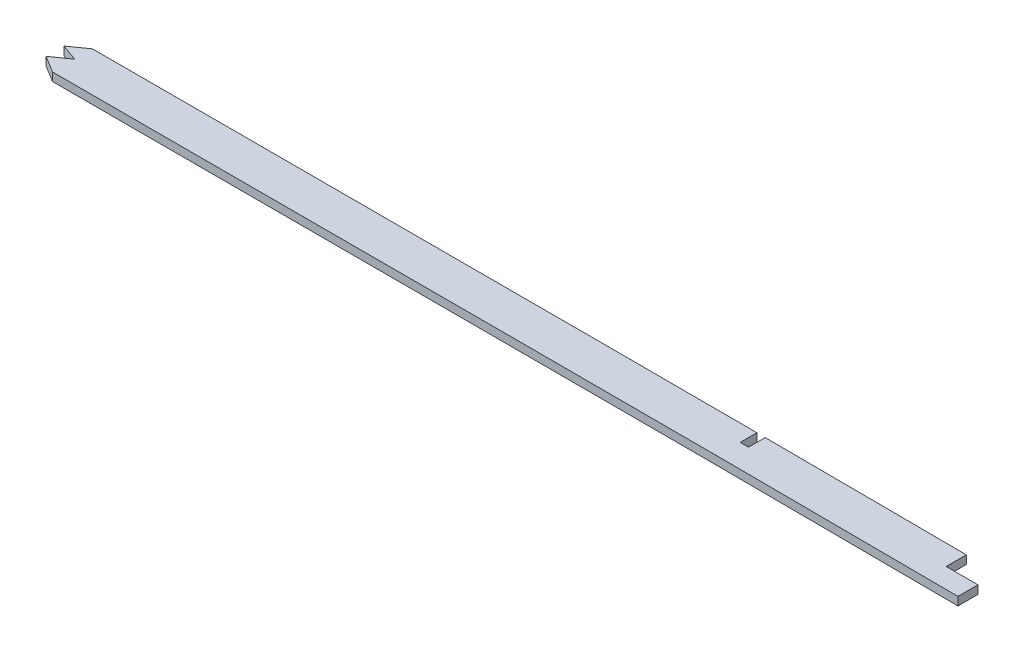
ISO-10303-21;
HEADER;
FILE_DESCRIPTION(('STEP AP214'),'2;1');
FILE_NAME('part.step','',(''),(''),'','','');
FILE_SCHEMA(('AUTOMOTIVE_DESIGN { 1 0 10303 214 1 1 1 1 }'));
ENDSEC;
DATA;
#1=APPLICATION_CONTEXT('core data for automotive mechanical design processes');
#2=APPLICATION_PROTOCOL_DEFINITION('international standard','automotive_design',2000,#1);
#3=PRODUCT_CONTEXT('',#1,'mechanical');
#4=PRODUCT('Part','Part','',(#3));
#5=PRODUCT_RELATED_PRODUCT_CATEGORY('part','',(#4));
#6=PRODUCT_DEFINITION_FORMATION('','',#4);
#7=PRODUCT_DEFINITION_CONTEXT('part definition',#1,'design');
#8=PRODUCT_DEFINITION('design','',#6,#7);
#9=PRODUCT_DEFINITION_SHAPE('','',#8);
#10=(LENGTH_UNIT() NAMED_UNIT(*) SI_UNIT(.MILLI.,.METRE.));
#11=(NAMED_UNIT(*) PLANE_ANGLE_UNIT() SI_UNIT($,.RADIAN.));
#12=(NAMED_UNIT(*) SI_UNIT($,.STERADIAN.) SOLID_ANGLE_UNIT());
#13=UNCERTAINTY_MEASURE_WITH_UNIT(LENGTH_MEASURE(1.E-05),#10,'distance_accuracy_value','');
#14=(GEOMETRIC_REPRESENTATION_CONTEXT(3) GLOBAL_UNCERTAINTY_ASSIGNED_CONTEXT((#13)) GLOBAL_UNIT_ASSIGNED_CONTEXT((#10,
#11,#12)) REPRESENTATION_CONTEXT('',''));
#15=CARTESIAN_POINT('',(0.,0.,0.));
#16=DIRECTION('',(0.,0.,1.));
#17=DIRECTION('',(1.,0.,0.));
#18=AXIS2_PLACEMENT_3D('',#15,#16,#17);
#19=CARTESIAN_POINT('',(616.337750913255,1.5875,99.0566103609531));
#20=CARTESIAN_POINT('',(647.76049660052,1.5875,99.0799542657679));
#21=CARTESIAN_POINT('',(694.87068034325,1.5875,98.960929783245));
#22=CARTESIAN_POINT('',(757.779786958647,1.5875,98.8040630386954));
#23=CARTESIAN_POINT('',(820.69045818609,1.5875,98.7653484328497));
#24=CARTESIAN_POINT('',(899.289299877085,1.5875,98.7967965825531));
#25=CARTESIAN_POINT('',(993.586772551322,1.5875,98.8129149281116));
#26=CARTESIAN_POINT('',(1087.93191592796,1.5875,98.7323574871025));
#27=CARTESIAN_POINT('',(1182.33953079348,1.5875,99.1244994990799));
#28=CARTESIAN_POINT('',(1276.65398068122,1.5875,99.8147611994573));
#29=CARTESIAN_POINT('',(1370.85083148495,1.5875,100.131815232071));
#30=CARTESIAN_POINT('',(1464.98207813977,1.5875,99.4108190462021));
#31=CARTESIAN_POINT('',(1590.54945268054,1.5875,97.1511702631117));
#32=CARTESIAN_POINT('',(1747.54008126415,1.5875,92.7833872927443));
#33=CARTESIAN_POINT('',(1904.58058478476,1.5875,87.4795525069474));
#34=CARTESIAN_POINT('',(2030.20455421821,1.5875,82.9558758992198));
#35=CARTESIAN_POINT('',(2092.98705848864,1.5875,80.5357121207426));
#36=CARTESIAN_POINT('',(2124.37829951673,1.5875,79.2527491986346));
#37=B_SPLINE_CURVE_WITH_KNOTS('',3,(#19,#20,#21,#22,#23,#24,#25,#26,#27,#28,#29,#30,#31,#32,#33,
#34,#35,#36),.UNSPECIFIED.,.F.,.F.,(4,1,1,1,1,1,1,1,1,1,1,1,1,1,1,4),(0.,0.0625,0.09375,0.125,
0.1875,0.25,0.3125,0.375,0.4375,0.5,0.5625,0.625,0.75,0.875,0.9375,1.),.UNSPECIFIED.);
#38=DIRECTION('',(0.,-1.,0.));
#39=VECTOR('',#38,1.);
#40=SURFACE_OF_LINEAR_EXTRUSION('',#37,#39);
#41=DIRECTION('',(0.,1.,0.));
#42=VECTOR('',#41,1.);
#43=CARTESIAN_POINT('',(862.726409079902,-6.0325,98.7825807380737));
#44=LINE('',#43,#42);
#45=CARTESIAN_POINT('',(862.725924528318,-1.5875,98.7829220342023));
#46=VERTEX_POINT('',#45);
#47=CARTESIAN_POINT('',(862.726409079902,1.5875,98.7825807380737));
#48=VERTEX_POINT('',#47);
#49=EDGE_CURVE('E303',#46,#48,#44,.T.);
#50=ORIENTED_EDGE('',*,*,#49,.T.);
#51=CARTESIAN_POINT('',(1116.0125,1.5875,98.877614065112));
#52=VERTEX_POINT('',#51);
#53=EDGE_CURVE('E172',#48,#52,#37,.T.);
#54=ORIENTED_EDGE('',*,*,#53,.T.);
#55=DIRECTION('',(0.,1.,0.));
#56=VECTOR('',#55,1.);
#57=CARTESIAN_POINT('',(1116.0125,-1.59253086897977,98.877614065112));
#58=LINE('',#57,#56);
#59=CARTESIAN_POINT('',(1116.01250018965,-1.58995471158141,98.8776762728788));
#60=VERTEX_POINT('',#59);
#61=EDGE_CURVE('E188',#60,#52,#58,.T.);
#62=ORIENTED_EDGE('',*,*,#61,.F.);
#63=CARTESIAN_POINT('',(1116.01250074187,-1.5875,98.8776140673808));
#64=CARTESIAN_POINT('',(1106.65531040723,-1.5875,98.8489981589266));
#65=CARTESIAN_POINT('',(1065.83646905134,-1.5875,98.7512238812234));
#66=CARTESIAN_POINT('',(993.586772551322,-1.5875,98.8129149281116));
#67=CARTESIAN_POINT('',(918.537042966882,-1.5875,98.8000866153137));
#68=CARTESIAN_POINT('',(874.913020706691,-1.5875,98.785692804558));
#69=CARTESIAN_POINT('',(862.72544015111,-1.5875,98.7825804906388));
#70=B_SPLINE_CURVE_WITH_KNOTS('',3,(#63,#64,#65,#66,#67,#68,#69),.UNSPECIFIED.,.F.,.F.,(4,1,1,1,
4),(0.163271988919623,0.181859857981132,0.244359857981132,0.306859857981132,0.331087869061508),.UNSPECIFIED.);
#71=EDGE_CURVE('E168',#46,#60,#70,.F.);
#72=ORIENTED_EDGE('',*,*,#71,.F.);
#73=EDGE_LOOP('',(#50,#54,#62,#72));
#74=FACE_BOUND('',#73,.T.);
#75=ADVANCED_FACE('F40',(#74),#40,.T.);
#76=DIRECTION('',(0.,-1.,0.));
#77=VECTOR('',#76,1.);
#78=CARTESIAN_POINT('',(1196.22315473829,1.5875,99.2567866166123));
#79=LINE('',#78,#77);
#80=CARTESIAN_POINT('',(1196.2231559473,-1.5875,99.2573829498002));
#81=VERTEX_POINT('',#80);
#82=CARTESIAN_POINT('',(1196.22315473829,1.5875,99.2567866166594));
#83=VERTEX_POINT('',#82);
#84=EDGE_CURVE('E324',#81,#83,#79,.F.);
#85=ORIENTED_EDGE('',*,*,#84,.F.);
#86=CARTESIAN_POINT('',(1196.22315959104,-1.5875,99.2567866463332));
#87=CARTESIAN_POINT('',(1191.59045311481,-1.5875,99.2284133842702));
#88=CARTESIAN_POINT('',(1165.91778618443,-1.5875,99.0751842298858));
#89=CARTESIAN_POINT('',(1140.23477346268,-1.5875,98.955060692758));
#90=CARTESIAN_POINT('',(1119.18750086786,-1.5875,98.8875606885981));
#91=B_SPLINE_CURVE_WITH_KNOTS('',3,(#86,#87,#88,#89,#90),.UNSPECIFIED.,.F.,.F.,(4,1,4),
(0.333190221464989,0.342397001392713,0.384206779927724),.UNSPECIFIED.);
#92=CARTESIAN_POINT('',(1119.1875002271,-1.58994771977053,98.8876302496902));
#93=VERTEX_POINT('',#92);
#94=EDGE_CURVE('E174',#93,#81,#91,.F.);
#95=ORIENTED_EDGE('',*,*,#94,.F.);
#96=DIRECTION('',(0.,1.,0.));
#97=VECTOR('',#96,1.);
#98=CARTESIAN_POINT('',(1119.18750000942,-1.59253086897977,98.8875606858451));
#99=LINE('',#98,#97);
#100=CARTESIAN_POINT('',(1119.18750000942,1.5875,98.8875606858451));
#101=VERTEX_POINT('',#100);
#102=EDGE_CURVE('E192',#93,#101,#99,.T.);
#103=ORIENTED_EDGE('',*,*,#102,.T.);
#104=EDGE_CURVE('E167',#101,#83,#37,.T.);
#105=ORIENTED_EDGE('',*,*,#104,.T.);
#106=EDGE_LOOP('',(#85,#95,#103,#105));
#107=FACE_BOUND('',#106,.T.);
#108=ADVANCED_FACE('F227',(#107),#40,.T.);
#109=CARTESIAN_POINT('',(616.326429146063,1.5875,114.296606155493));
#110=CARTESIAN_POINT('',(632.046217380175,1.5875,114.30828435968));
#111=CARTESIAN_POINT('',(647.765968153244,1.5875,114.29677439422));
#112=CARTESIAN_POINT('',(679.205420392794,1.5875,114.24323397025));
#113=CARTESIAN_POINT('',(694.925123066751,1.5875,114.201950932506));
#114=CARTESIAN_POINT('',(726.364532124698,1.5875,114.121681346548));
#115=CARTESIAN_POINT('',(742.084243399862,1.5875,114.083543006226));
#116=CARTESIAN_POINT('',(773.523671882744,1.5875,114.034083388907));
#117=CARTESIAN_POINT('',(789.243390213417,1.5875,114.023396075664));
#118=CARTESIAN_POINT('',(820.682831324826,1.5875,114.017303041489));
#119=CARTESIAN_POINT('',(836.402553623007,1.5875,114.020240225192));
#120=CARTESIAN_POINT('',(867.841997842806,1.5875,114.024821457385));
#121=CARTESIAN_POINT('',(883.561720421664,1.5875,114.028722489467));
#122=CARTESIAN_POINT('',(915.001165910892,1.5875,114.037662965197));
#123=CARTESIAN_POINT('',(930.720888644625,1.5875,114.042095840025));
#124=CARTESIAN_POINT('',(962.160332217753,1.5875,114.044456392842));
#125=CARTESIAN_POINT('',(977.880053630737,1.5875,114.042025852399));
#126=CARTESIAN_POINT('',(1025.03924062521,1.5875,114.02635266127));
#127=CARTESIAN_POINT('',(1056.47872633141,1.5875,114.001081239981));
#128=CARTESIAN_POINT('',(1103.63774370583,1.5875,114.076141518065));
#129=CARTESIAN_POINT('',(1119.35738201238,1.5875,114.119430036675));
#130=CARTESIAN_POINT('',(1150.79658971577,1.5875,114.242868384306));
#131=CARTESIAN_POINT('',(1166.51615941665,1.5875,114.322855573181));
#132=CARTESIAN_POINT('',(1213.67480633689,1.5875,114.596079866728));
#133=CARTESIAN_POINT('',(1245.11381381393,1.5875,114.824335417931));
#134=CARTESIAN_POINT('',(1307.99206873737,1.5875,115.160349224997));
#135=CARTESIAN_POINT('',(1339.43132783757,1.5875,115.262775920084));
#136=CARTESIAN_POINT('',(1386.59071758969,1.5875,115.166774968219));
#137=CARTESIAN_POINT('',(1402.31059775436,1.5875,115.09313610926));
#138=CARTESIAN_POINT('',(1433.75053971329,1.5875,114.855373393272));
#139=CARTESIAN_POINT('',(1449.46971812607,1.5875,114.691491377402));
#140=CARTESIAN_POINT('',(1480.90524720166,1.5875,114.282993412757));
#141=CARTESIAN_POINT('',(1496.62184273389,1.5875,114.038617844409));
#142=CARTESIAN_POINT('',(1528.05323424889,1.5875,113.488096449305));
#143=CARTESIAN_POINT('',(1543.76803918056,1.5875,113.182257797232));
#144=CARTESIAN_POINT('',(1590.91012672281,1.5875,112.184857954141));
#145=CARTESIAN_POINT('',(1622.33508716355,1.5875,111.413587350345));
#146=CARTESIAN_POINT('',(1685.18062244756,1.5875,109.720508746898));
#147=CARTESIAN_POINT('',(1716.60120600918,1.5875,108.799000007991));
#148=CARTESIAN_POINT('',(1779.43954296825,1.5875,106.858836007746));
#149=CARTESIAN_POINT('',(1810.85730451947,1.5875,105.840460627799));
#150=CARTESIAN_POINT('',(1873.69102784609,1.5875,103.741931839349));
#151=CARTESIAN_POINT('',(1905.10699770462,1.5875,102.662055887814));
#152=CARTESIAN_POINT('',(1967.93740090808,1.5875,100.449562537391));
#153=CARTESIAN_POINT('',(1999.35184226252,1.5875,99.3172200683351));
#154=CARTESIAN_POINT('',(2062.17844269824,1.5875,96.9741951872324));
#155=CARTESIAN_POINT('',(2093.59060920955,1.5875,95.7637678134024));
#156=CARTESIAN_POINT('',(2125.00064017427,1.5875,94.4800369448474));
#157=B_SPLINE_CURVE_WITH_KNOTS('',3,(#109,#110,#111,#112,#113,#114,#115,#116,#117,#118,#119,
#120,#121,#122,#123,#124,#125,#126,#127,#128,#129,#130,#131,#132,#133,#134,#135,#136,#137,#138,
#139,#140,#141,#142,#143,#144,#145,#146,#147,#148,#149,#150,#151,#152,#153,#154,#155,#156),
.UNSPECIFIED.,.F.,.F.,(4,2,2,2,2,2,2,2,2,2,2,2,2,2,2,2,2,2,2,2,2,2,2,4),(0.,0.0312499999999999,
0.0624999999999998,0.0937499999999997,0.125,0.156249999999999,0.187499999999999,
0.218749999999999,0.249999999999999,0.312499999999999,0.343749999999999,0.374999999999999,
0.437499999999998,0.499999999999998,0.531249999999998,0.562499999999998,0.593749999999999,
0.624999999999999,0.687499999999999,0.749999999999999,0.812499999999999,0.875,0.9375,1.),.UNSPECIFIED.);
#158=DIRECTION('',(0.,-1.,0.));
#159=VECTOR('',#158,1.);
#160=SURFACE_OF_LINEAR_EXTRUSION('',#157,#159);
#161=CARTESIAN_POINT('',(1208.33439349657,1.5875,114.573476594544));
#162=CARTESIAN_POINT('',(1199.63483574893,1.5875,114.518266469403));
#163=CARTESIAN_POINT('',(1190.9352755331,1.5875,114.464333248765));
#164=CARTESIAN_POINT('',(1166.51615941665,1.5875,114.322855573181));
#165=CARTESIAN_POINT('',(1150.79658971577,1.5875,114.242868384306));
#166=CARTESIAN_POINT('',(1119.35738201238,1.5875,114.119430036675));
#167=CARTESIAN_POINT('',(1103.63774370583,1.5875,114.076141518065));
#168=CARTESIAN_POINT('',(1056.47872633141,1.5875,114.001081239981));
#169=CARTESIAN_POINT('',(1025.03924062521,1.5875,114.02635266127));
#170=CARTESIAN_POINT('',(977.880053630737,1.5875,114.042025852399));
#171=CARTESIAN_POINT('',(962.160332217753,1.5875,114.044456392842));
#172=CARTESIAN_POINT('',(930.720888644625,1.5875,114.042095840025));
#173=CARTESIAN_POINT('',(915.001165910892,1.5875,114.037662965197));
#174=CARTESIAN_POINT('',(887.096435546386,1.5875,114.029727660973));
#175=CARTESIAN_POINT('',(874.911428026087,1.5875,114.026604598587));
#176=CARTESIAN_POINT('',(862.726420746595,1.5875,114.024308472553));
#177=B_SPLINE_CURVE_WITH_KNOTS('',3,(#161,#162,#163,#164,#165,#166,#167,#168,#169,#170,#171,
#172,#173,#174,#175,#176),.UNSPECIFIED.,.F.,.F.,(4,2,2,2,2,2,2,4),(0.163276831798633,
0.180571314845172,0.211821314845171,0.243071314845171,0.305571314845171,0.336821314845171,
0.368071314845171,0.392294483046537),.UNSPECIFIED.);
#178=CARTESIAN_POINT('',(862.726420745253,1.5875,114.024315595952));
#179=VERTEX_POINT('',#178);
#180=CARTESIAN_POINT('',(1208.33439305176,1.5875,114.573511769636));
#181=VERTEX_POINT('',#180);
#182=EDGE_CURVE('E157',#179,#181,#177,.F.);
#183=ORIENTED_EDGE('',*,*,#182,.F.);
#184=DIRECTION('',(0.,1.,0.));
#185=VECTOR('',#184,1.);
#186=CARTESIAN_POINT('',(862.726409079902,-6.0325,114.024308470354));
#187=LINE('',#186,#185);
#188=CARTESIAN_POINT('',(862.726414914492,-1.5875,114.024312034321));
#189=VERTEX_POINT('',#188);
#190=EDGE_CURVE('E139',#189,#179,#187,.T.);
#191=ORIENTED_EDGE('',*,*,#190,.F.);
#192=CARTESIAN_POINT('',(862.726420750438,-1.5875,114.024308472554));
#193=CARTESIAN_POINT('',(874.911428028649,-1.5875,114.026604598588));
#194=CARTESIAN_POINT('',(887.096435547667,-1.5875,114.029727660974));
#195=CARTESIAN_POINT('',(915.001165910892,-1.5875,114.037662965197));
#196=CARTESIAN_POINT('',(930.720888644625,-1.5875,114.042095840025));
#197=CARTESIAN_POINT('',(962.160332217753,-1.5875,114.044456392842));
#198=CARTESIAN_POINT('',(977.880053630737,-1.5875,114.042025852399));
#199=CARTESIAN_POINT('',(1025.03924062521,-1.5875,114.02635266127));
#200=CARTESIAN_POINT('',(1056.47872633141,-1.5875,114.001081239981));
#201=CARTESIAN_POINT('',(1103.63774370583,-1.5875,114.076141518065));
#202=CARTESIAN_POINT('',(1119.35738201238,-1.5875,114.119430036675));
#203=CARTESIAN_POINT('',(1150.79658971577,-1.5875,114.242868384306));
#204=CARTESIAN_POINT('',(1166.51615941665,-1.5875,114.322855573181));
#205=CARTESIAN_POINT('',(1190.93527553355,-1.5875,114.464333248767));
#206=CARTESIAN_POINT('',(1199.63483574983,-1.5875,114.518266469408));
#207=CARTESIAN_POINT('',(1208.33439349792,-1.5875,114.573476594553));
#208=B_SPLINE_CURVE_WITH_KNOTS('',3,(#192,#193,#194,#195,#196,#197,#198,#199,#200,#201,#202,
#203,#204,#205,#206,#207),.UNSPECIFIED.,.F.,.F.,(4,2,2,2,2,2,2,4),(0.163276831801179,
0.187499999999999,0.218749999999999,0.249999999999999,0.312499999999999,0.343749999999999,
0.374999999999999,0.392294483047431),.UNSPECIFIED.);
#209=CARTESIAN_POINT('',(1208.33439316259,-1.5875,114.573529382344));
#210=VERTEX_POINT('',#209);
#211=EDGE_CURVE('E182',#189,#210,#208,.T.);
#212=ORIENTED_EDGE('',*,*,#211,.T.);
#213=DIRECTION('',(0.,-1.,0.));
#214=VECTOR('',#213,1.);
#215=CARTESIAN_POINT('',(1208.33439305176,1.5875,114.573476591721));
#216=LINE('',#215,#214);
#217=EDGE_CURVE('E165',#210,#181,#216,.F.);
#218=ORIENTED_EDGE('',*,*,#217,.T.);
#219=EDGE_LOOP('',(#183,#191,#212,#218));
#220=FACE_BOUND('',#219,.T.);
#221=ADVANCED_FACE('F42',(#220),#160,.F.);
#222=CARTESIAN_POINT('',(0.,1.5875,0.));
#223=DIRECTION('',(0.,1.,0.));
#224=DIRECTION('',(0.,0.,1.));
#225=AXIS2_PLACEMENT_3D('',#222,#223,#224);
#226=PLANE('',#225);
#227=DIRECTION('',(0.817598794620829,0.,-0.575788338744861));
#228=VECTOR('',#227,1.);
#229=CARTESIAN_POINT('',(862.726409079902,1.5875,98.7825807380737));
#230=LINE('',#229,#228);
#231=CARTESIAN_POINT('',(856.314728224219,1.5875,103.297962968019));
#232=VERTEX_POINT('',#231);
#233=EDGE_CURVE('E150',#232,#48,#230,.T.);
#234=ORIENTED_EDGE('',*,*,#233,.F.);
#235=DIRECTION('',(-0.941527703429056,0.,-0.336935577930867));
#236=VECTOR('',#235,1.);
#237=CARTESIAN_POINT('',(856.314728224219,1.5875,103.297962968019));
#238=LINE('',#237,#236);
#239=CARTESIAN_POINT('',(862.726409079902,1.5875,105.592450306788));
#240=VERTEX_POINT('',#239);
#241=EDGE_CURVE('E373',#240,#232,#238,.T.);
#242=ORIENTED_EDGE('',*,*,#241,.F.);
#243=DIRECTION('',(0.81759879462083,0.,-0.57578833874486));
#244=VECTOR('',#243,1.);
#245=CARTESIAN_POINT('',(862.726409079902,1.5875,105.592450306788));
#246=LINE('',#245,#244);
#247=CARTESIAN_POINT('',(856.314728224219,1.5875,110.107832536734));
#248=VERTEX_POINT('',#247);
#249=EDGE_CURVE('E160',#248,#240,#246,.T.);
#250=ORIENTED_EDGE('',*,*,#249,.F.);
#251=DIRECTION('',(-0.853386844339415,0.,-0.521278134884263));
#252=VECTOR('',#251,1.);
#253=CARTESIAN_POINT('',(856.314728224219,1.5875,110.107832536734));
#254=LINE('',#253,#252);
#255=EDGE_CURVE('E142',#179,#248,#254,.T.);
#256=ORIENTED_EDGE('',*,*,#255,.F.);
#257=ORIENTED_EDGE('',*,*,#182,.T.);
#258=DIRECTION('',(0.,0.,1.));
#259=VECTOR('',#258,1.);
#260=CARTESIAN_POINT('',(1208.33439305176,1.5875,120.259186156619));
#261=LINE('',#260,#259);
#262=CARTESIAN_POINT('',(1208.33439305176,1.5875,106.937874616711));
#263=VERTEX_POINT('',#262);
#264=EDGE_CURVE('E315',#263,#181,#261,.T.);
#265=ORIENTED_EDGE('',*,*,#264,.F.);
#266=DIRECTION('',(1.,0.,0.));
#267=VECTOR('',#266,1.);
#268=CARTESIAN_POINT('',(1196.22315473829,1.5875,106.937874616711));
#269=LINE('',#268,#267);
#270=CARTESIAN_POINT('',(1196.22315473829,1.5875,106.937874616711));
#271=VERTEX_POINT('',#270);
#272=EDGE_CURVE('E311',#271,#263,#269,.T.);
#273=ORIENTED_EDGE('',*,*,#272,.F.);
#274=DIRECTION('',(0.,0.,1.));
#275=VECTOR('',#274,1.);
#276=CARTESIAN_POINT('',(1196.22315473829,1.5875,99.2567866166123));
#277=LINE('',#276,#275);
#278=EDGE_CURVE('E308',#83,#271,#277,.T.);
#279=ORIENTED_EDGE('',*,*,#278,.F.);
#280=ORIENTED_EDGE('',*,*,#104,.F.);
#281=DIRECTION('',(-5.24930824727474E-13,0.,-1.));
#282=VECTOR('',#281,1.);
#283=CARTESIAN_POINT('',(1119.18749999994,1.5875,-5.8749601739965E-10));
#284=LINE('',#283,#282);
#285=CARTESIAN_POINT('',(1119.1875,1.5875,105.232528283411));
#286=VERTEX_POINT('',#285);
#287=EDGE_CURVE('E351',#286,#101,#284,.T.);
#288=ORIENTED_EDGE('',*,*,#287,.F.);
#289=DIRECTION('',(1.,0.,0.));
#290=VECTOR('',#289,1.);
#291=CARTESIAN_POINT('',(0.,1.5875,105.232528283411));
#292=LINE('',#291,#290);
#293=CARTESIAN_POINT('',(1116.0125,1.5875,105.232528283411));
#294=VERTEX_POINT('',#293);
#295=EDGE_CURVE('E364',#294,#286,#292,.T.);
#296=ORIENTED_EDGE('',*,*,#295,.F.);
#297=DIRECTION('',(0.,0.,1.));
#298=VECTOR('',#297,1.);
#299=CARTESIAN_POINT('',(1116.0125,1.5875,0.));
#300=LINE('',#299,#298);
#301=EDGE_CURVE('E331',#52,#294,#300,.T.);
#302=ORIENTED_EDGE('',*,*,#301,.F.);
#303=ORIENTED_EDGE('',*,*,#53,.F.);
#304=EDGE_LOOP('',(#234,#242,#250,#256,#257,#265,#273,#279,#280,#288,#296,#302,#303));
#305=FACE_BOUND('',#304,.T.);
#306=ADVANCED_FACE('F155',(#305),#226,.T.);
#307=CARTESIAN_POINT('',(0.,-1.5875,0.));
#308=DIRECTION('',(0.,1.,0.));
#309=DIRECTION('',(0.,0.,1.));
#310=AXIS2_PLACEMENT_3D('',#307,#308,#309);
#311=PLANE('',#310);
#312=DIRECTION('',(-0.941527703429056,0.,-0.336935577930867));
#313=VECTOR('',#312,1.);
#314=CARTESIAN_POINT('',(64.44398466162,-1.5875,-180.081299965069));
#315=LINE('',#314,#313);
#316=CARTESIAN_POINT('',(862.726409079902,-1.5875,105.592450306788));
#317=VERTEX_POINT('',#316);
#318=CARTESIAN_POINT('',(856.314728224219,-1.5875,103.297962968019));
#319=VERTEX_POINT('',#318);
#320=EDGE_CURVE('E53',#317,#319,#315,.T.);
#321=ORIENTED_EDGE('',*,*,#320,.T.);
#322=DIRECTION('',(0.817598794620829,0.,-0.575788338744861));
#323=VECTOR('',#322,1.);
#324=CARTESIAN_POINT('',(332.524862110729,-1.5875,472.173380648578));
#325=LINE('',#324,#323);
#326=EDGE_CURVE('E11',#319,#46,#325,.T.);
#327=ORIENTED_EDGE('',*,*,#326,.T.);
#328=ORIENTED_EDGE('',*,*,#71,.T.);
#329=DIRECTION('',(0.,0.,1.));
#330=VECTOR('',#329,1.);
#331=CARTESIAN_POINT('',(1116.0125,-1.5875,0.));
#332=LINE('',#331,#330);
#333=CARTESIAN_POINT('',(1116.0125,-1.5875,105.232528283411));
#334=VERTEX_POINT('',#333);
#335=EDGE_CURVE('E255',#60,#334,#332,.T.);
#336=ORIENTED_EDGE('',*,*,#335,.T.);
#337=DIRECTION('',(1.,0.,0.));
#338=VECTOR('',#337,1.);
#339=CARTESIAN_POINT('',(0.,-1.5875,105.232528283411));
#340=LINE('',#339,#338);
#341=CARTESIAN_POINT('',(1119.1875,-1.5875,105.232528283411));
#342=VERTEX_POINT('',#341);
#343=EDGE_CURVE('E217',#334,#342,#340,.T.);
#344=ORIENTED_EDGE('',*,*,#343,.T.);
#345=DIRECTION('',(-5.24930824727474E-13,0.,-1.));
#346=VECTOR('',#345,1.);
#347=CARTESIAN_POINT('',(1119.18749999994,-1.5875,-5.8749601739965E-10));
#348=LINE('',#347,#346);
#349=EDGE_CURVE('E252',#342,#93,#348,.T.);
#350=ORIENTED_EDGE('',*,*,#349,.T.);
#351=ORIENTED_EDGE('',*,*,#94,.T.);
#352=DIRECTION('',(0.,0.,1.));
#353=VECTOR('',#352,1.);
#354=CARTESIAN_POINT('',(1196.22315473829,-1.5875,0.));
#355=LINE('',#354,#353);
#356=CARTESIAN_POINT('',(1196.22315473829,-1.5875,106.937874616711));
#357=VERTEX_POINT('',#356);
#358=EDGE_CURVE('E260',#81,#357,#355,.T.);
#359=ORIENTED_EDGE('',*,*,#358,.T.);
#360=DIRECTION('',(1.,0.,0.));
#361=VECTOR('',#360,1.);
#362=CARTESIAN_POINT('',(0.,-1.5875,106.937874616711));
#363=LINE('',#362,#361);
#364=CARTESIAN_POINT('',(1208.33439305176,-1.5875,106.937874616711));
#365=VERTEX_POINT('',#364);
#366=EDGE_CURVE('E263',#357,#365,#363,.T.);
#367=ORIENTED_EDGE('',*,*,#366,.T.);
#368=DIRECTION('',(0.,0.,1.));
#369=VECTOR('',#368,1.);
#370=CARTESIAN_POINT('',(1208.33439305176,-1.5875,0.));
#371=LINE('',#370,#369);
#372=EDGE_CURVE('E267',#365,#210,#371,.T.);
#373=ORIENTED_EDGE('',*,*,#372,.T.);
#374=ORIENTED_EDGE('',*,*,#211,.F.);
#375=DIRECTION('',(-0.853386844339415,0.,-0.521278134884263));
#376=VECTOR('',#375,1.);
#377=CARTESIAN_POINT('',(183.705487777464,-1.5875,-300.745103258648));
#378=LINE('',#377,#376);
#379=CARTESIAN_POINT('',(856.314728224219,-1.5875,110.107832536734));
#380=VERTEX_POINT('',#379);
#381=EDGE_CURVE('E145',#189,#380,#378,.T.);
#382=ORIENTED_EDGE('',*,*,#381,.T.);
#383=DIRECTION('',(0.81759879462083,0.,-0.57578833874486));
#384=VECTOR('',#383,1.);
#385=CARTESIAN_POINT('',(335.73070253857,-1.5875,476.725559102319));
#386=LINE('',#385,#384);
#387=EDGE_CURVE('E280',#380,#317,#386,.T.);
#388=ORIENTED_EDGE('',*,*,#387,.T.);
#389=EDGE_LOOP('',(#321,#327,#328,#336,#344,#350,#351,#359,#367,#373,#374,#382,#388));
#390=FACE_BOUND('',#389,.T.);
#391=ADVANCED_FACE('F229',(#390),#311,.F.);
#392=CARTESIAN_POINT('',(1116.0125,-1.59253086897977,0.));
#393=DIRECTION('',(-1.,0.,0.));
#394=DIRECTION('',(0.,0.,1.));
#395=AXIS2_PLACEMENT_3D('',#392,#393,#394);
#396=PLANE('',#395);
#397=ORIENTED_EDGE('',*,*,#61,.T.);
#398=ORIENTED_EDGE('',*,*,#301,.T.);
#399=DIRECTION('',(0.,1.,0.));
#400=VECTOR('',#399,1.);
#401=CARTESIAN_POINT('',(1116.0125,-1.59253086897977,105.232528283411));
#402=LINE('',#401,#400);
#403=EDGE_CURVE('E356',#334,#294,#402,.T.);
#404=ORIENTED_EDGE('',*,*,#403,.F.);
#405=ORIENTED_EDGE('',*,*,#335,.F.);
#406=EDGE_LOOP('',(#397,#398,#404,#405));
#407=FACE_BOUND('',#406,.T.);
#408=ADVANCED_FACE('F357',(#407),#396,.F.);
#409=CARTESIAN_POINT('',(1119.18749999994,-1.59253086897977,-5.8749601739965E-10));
#410=DIRECTION('',(1.,0.,-5.24930824727474E-13));
#411=DIRECTION('',(-5.24930824727474E-13,0.,-1.));
#412=AXIS2_PLACEMENT_3D('',#409,#410,#411);
#413=PLANE('',#412);
#414=DIRECTION('',(0.,1.,0.));
#415=VECTOR('',#414,1.);
#416=CARTESIAN_POINT('',(1119.1875,-1.59253086897977,105.232528283411));
#417=LINE('',#416,#415);
#418=EDGE_CURVE('E200',#342,#286,#417,.T.);
#419=ORIENTED_EDGE('',*,*,#418,.T.);
#420=ORIENTED_EDGE('',*,*,#287,.T.);
#421=ORIENTED_EDGE('',*,*,#102,.F.);
#422=ORIENTED_EDGE('',*,*,#349,.F.);
#423=EDGE_LOOP('',(#419,#420,#421,#422));
#424=FACE_BOUND('',#423,.T.);
#425=ADVANCED_FACE('F350',(#424),#413,.F.);
#426=CARTESIAN_POINT('',(0.,-1.59253086897977,105.232528283411));
#427=DIRECTION('',(0.,0.,1.));
#428=DIRECTION('',(1.,0.,0.));
#429=AXIS2_PLACEMENT_3D('',#426,#427,#428);
#430=PLANE('',#429);
#431=ORIENTED_EDGE('',*,*,#403,.T.);
#432=ORIENTED_EDGE('',*,*,#295,.T.);
#433=ORIENTED_EDGE('',*,*,#418,.F.);
#434=ORIENTED_EDGE('',*,*,#343,.F.);
#435=EDGE_LOOP('',(#431,#432,#433,#434));
#436=FACE_BOUND('',#435,.T.);
#437=ADVANCED_FACE('F354',(#436),#430,.F.);
#438=CARTESIAN_POINT('',(1208.33439305176,-6.0325,120.259186156619));
#439=DIRECTION('',(-1.,0.,0.));
#440=DIRECTION('',(0.,0.,1.));
#441=AXIS2_PLACEMENT_3D('',#438,#439,#440);
#442=PLANE('',#441);
#443=ORIENTED_EDGE('',*,*,#372,.F.);
#444=DIRECTION('',(0.,1.,0.));
#445=VECTOR('',#444,1.);
#446=CARTESIAN_POINT('',(1208.33439305176,-6.0325,106.937874616711));
#447=LINE('',#446,#445);
#448=EDGE_CURVE('E162',#365,#263,#447,.T.);
#449=ORIENTED_EDGE('',*,*,#448,.T.);
#450=ORIENTED_EDGE('',*,*,#264,.T.);
#451=ORIENTED_EDGE('',*,*,#217,.F.);
#452=EDGE_LOOP('',(#443,#449,#450,#451));
#453=FACE_BOUND('',#452,.T.);
#454=ADVANCED_FACE('F342',(#453),#442,.F.);
#455=CARTESIAN_POINT('',(1196.22315473829,-6.0325,106.937874616711));
#456=DIRECTION('',(0.,0.,1.));
#457=DIRECTION('',(1.,0.,0.));
#458=AXIS2_PLACEMENT_3D('',#455,#456,#457);
#459=PLANE('',#458);
#460=DIRECTION('',(0.,1.,0.));
#461=VECTOR('',#460,1.);
#462=CARTESIAN_POINT('',(1196.22315473829,-6.0325,106.937874616711));
#463=LINE('',#462,#461);
#464=EDGE_CURVE('E69',#357,#271,#463,.T.);
#465=ORIENTED_EDGE('',*,*,#464,.T.);
#466=ORIENTED_EDGE('',*,*,#272,.T.);
#467=ORIENTED_EDGE('',*,*,#448,.F.);
#468=ORIENTED_EDGE('',*,*,#366,.F.);
#469=EDGE_LOOP('',(#465,#466,#467,#468));
#470=FACE_BOUND('',#469,.T.);
#471=ADVANCED_FACE('F344',(#470),#459,.F.);
#472=CARTESIAN_POINT('',(1196.22315473829,-6.0325,99.2567866166123));
#473=DIRECTION('',(-1.,0.,0.));
#474=DIRECTION('',(0.,0.,1.));
#475=AXIS2_PLACEMENT_3D('',#472,#473,#474);
#476=PLANE('',#475);
#477=ORIENTED_EDGE('',*,*,#84,.T.);
#478=ORIENTED_EDGE('',*,*,#278,.T.);
#479=ORIENTED_EDGE('',*,*,#464,.F.);
#480=ORIENTED_EDGE('',*,*,#358,.F.);
#481=EDGE_LOOP('',(#477,#478,#479,#480));
#482=FACE_BOUND('',#481,.T.);
#483=ADVANCED_FACE('F383',(#482),#476,.F.);
#484=CARTESIAN_POINT('',(862.726409079902,-6.0325,98.7825807380737));
#485=DIRECTION('',(0.575788338744861,0.,0.817598794620829));
#486=DIRECTION('',(0.817598794620829,0.,-0.575788338744861));
#487=AXIS2_PLACEMENT_3D('',#484,#485,#486);
#488=PLANE('',#487);
#489=DIRECTION('',(0.,1.,0.));
#490=VECTOR('',#489,1.);
#491=CARTESIAN_POINT('',(856.314728224219,-6.0325,103.297962968019));
#492=LINE('',#491,#490);
#493=EDGE_CURVE('E296',#319,#232,#492,.T.);
#494=ORIENTED_EDGE('',*,*,#493,.T.);
#495=ORIENTED_EDGE('',*,*,#233,.T.);
#496=ORIENTED_EDGE('',*,*,#49,.F.);
#497=ORIENTED_EDGE('',*,*,#326,.F.);
#498=EDGE_LOOP('',(#494,#495,#496,#497));
#499=FACE_BOUND('',#498,.T.);
#500=ADVANCED_FACE('F381',(#499),#488,.F.);
#501=CARTESIAN_POINT('',(856.314728224219,-6.0325,103.297962968019));
#502=DIRECTION('',(0.336935577930867,0.,-0.941527703429056));
#503=DIRECTION('',(-0.941527703429056,0.,-0.336935577930867));
#504=AXIS2_PLACEMENT_3D('',#501,#502,#503);
#505=PLANE('',#504);
#506=DIRECTION('',(0.,1.,0.));
#507=VECTOR('',#506,1.);
#508=CARTESIAN_POINT('',(862.726409079902,-6.0325,105.592450306788));
#509=LINE('',#508,#507);
#510=EDGE_CURVE('E295',#317,#240,#509,.T.);
#511=ORIENTED_EDGE('',*,*,#510,.T.);
#512=ORIENTED_EDGE('',*,*,#241,.T.);
#513=ORIENTED_EDGE('',*,*,#493,.F.);
#514=ORIENTED_EDGE('',*,*,#320,.F.);
#515=EDGE_LOOP('',(#511,#512,#513,#514));
#516=FACE_BOUND('',#515,.T.);
#517=ADVANCED_FACE('F293',(#516),#505,.F.);
#518=CARTESIAN_POINT('',(862.726409079902,-6.0325,105.592450306788));
#519=DIRECTION('',(0.57578833874486,0.,0.81759879462083));
#520=DIRECTION('',(0.81759879462083,0.,-0.57578833874486));
#521=AXIS2_PLACEMENT_3D('',#518,#519,#520);
#522=PLANE('',#521);
#523=DIRECTION('',(0.,1.,0.));
#524=VECTOR('',#523,1.);
#525=CARTESIAN_POINT('',(856.314728224219,-6.0325,110.107832536734));
#526=LINE('',#525,#524);
#527=EDGE_CURVE('E61',#380,#248,#526,.T.);
#528=ORIENTED_EDGE('',*,*,#527,.T.);
#529=ORIENTED_EDGE('',*,*,#249,.T.);
#530=ORIENTED_EDGE('',*,*,#510,.F.);
#531=ORIENTED_EDGE('',*,*,#387,.F.);
#532=EDGE_LOOP('',(#528,#529,#530,#531));
#533=FACE_BOUND('',#532,.T.);
#534=ADVANCED_FACE('F298',(#533),#522,.F.);
#535=CARTESIAN_POINT('',(856.314728224219,-6.0325,110.107832536734));
#536=DIRECTION('',(0.521278134884263,0.,-0.853386844339415));
#537=DIRECTION('',(-0.853386844339415,0.,-0.521278134884263));
#538=AXIS2_PLACEMENT_3D('',#535,#536,#537);
#539=PLANE('',#538);
#540=ORIENTED_EDGE('',*,*,#190,.T.);
#541=ORIENTED_EDGE('',*,*,#255,.T.);
#542=ORIENTED_EDGE('',*,*,#527,.F.);
#543=ORIENTED_EDGE('',*,*,#381,.F.);
#544=EDGE_LOOP('',(#540,#541,#542,#543));
#545=FACE_BOUND('',#544,.T.);
#546=ADVANCED_FACE('F141',(#545),#539,.F.);
#547=CLOSED_SHELL('',(#75,#108,#221,#306,#391,#408,#425,#437,#454,#471,#483,#500,#517,#534,#546));
#548=MANIFOLD_SOLID_BREP('B2',#547);
#549=ADVANCED_BREP_SHAPE_REPRESENTATION('',(#18,#548),#14);
#550=SHAPE_DEFINITION_REPRESENTATION(#9,#549);
ENDSEC;
END-ISO-10303-21;
